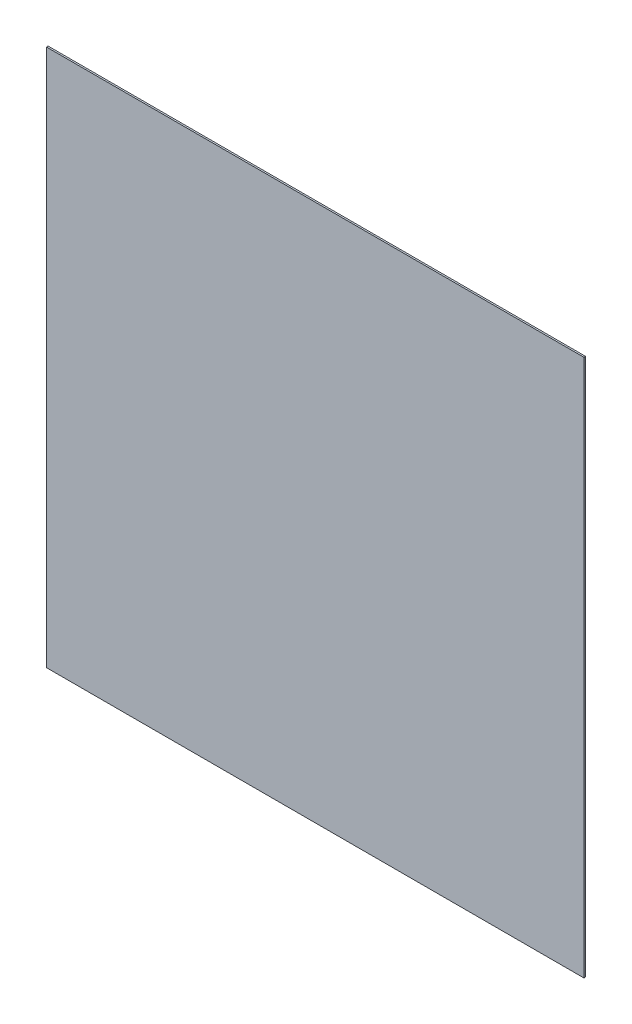
ISO-10303-21;
HEADER;
FILE_DESCRIPTION(('STEP AP214'),'2;1');
FILE_NAME('part.step','',(''),(''),'','','');
FILE_SCHEMA(('AUTOMOTIVE_DESIGN { 1 0 10303 214 1 1 1 1 }'));
ENDSEC;
DATA;
#1=APPLICATION_CONTEXT('core data for automotive mechanical design processes');
#2=APPLICATION_PROTOCOL_DEFINITION('international standard','automotive_design',2000,#1);
#3=PRODUCT_CONTEXT('',#1,'mechanical');
#4=PRODUCT('Part','Part','',(#3));
#5=PRODUCT_RELATED_PRODUCT_CATEGORY('part','',(#4));
#6=PRODUCT_DEFINITION_FORMATION('','',#4);
#7=PRODUCT_DEFINITION_CONTEXT('part definition',#1,'design');
#8=PRODUCT_DEFINITION('design','',#6,#7);
#9=PRODUCT_DEFINITION_SHAPE('','',#8);
#10=(LENGTH_UNIT() NAMED_UNIT(*) SI_UNIT(.MILLI.,.METRE.));
#11=(NAMED_UNIT(*) PLANE_ANGLE_UNIT() SI_UNIT($,.RADIAN.));
#12=(NAMED_UNIT(*) SI_UNIT($,.STERADIAN.) SOLID_ANGLE_UNIT());
#13=UNCERTAINTY_MEASURE_WITH_UNIT(LENGTH_MEASURE(1.E-05),#10,'distance_accuracy_value','');
#14=(GEOMETRIC_REPRESENTATION_CONTEXT(3) GLOBAL_UNCERTAINTY_ASSIGNED_CONTEXT((#13)) GLOBAL_UNIT_ASSIGNED_CONTEXT((#10,
#11,#12)) REPRESENTATION_CONTEXT('',''));
#15=CARTESIAN_POINT('',(0.,0.,0.));
#16=DIRECTION('',(0.,0.,1.));
#17=DIRECTION('',(1.,0.,0.));
#18=AXIS2_PLACEMENT_3D('',#15,#16,#17);
#19=CARTESIAN_POINT('',(0.221931906506307,36.6605550842403,13.76934));
#20=DIRECTION('',(0.,-1.,0.));
#21=DIRECTION('',(0.,0.,-1.));
#22=AXIS2_PLACEMENT_3D('',#19,#20,#21);
#23=PLANE('',#22);
#24=DIRECTION('',(-1.,0.,0.));
#25=VECTOR('',#24,1.);
#26=CARTESIAN_POINT('',(5.17493190650631,36.6605550842403,13.7414));
#27=LINE('',#26,#25);
#28=CARTESIAN_POINT('',(9.30243190650632,36.6605550842403,13.7414));
#29=VERTEX_POINT('',#28);
#30=CARTESIAN_POINT('',(1.04743190650631,36.6605550842403,13.7414));
#31=VERTEX_POINT('',#30);
#32=EDGE_CURVE('E77',#29,#31,#27,.T.);
#33=ORIENTED_EDGE('',*,*,#32,.F.);
#34=DIRECTION('',(0.,0.,-1.));
#35=VECTOR('',#34,1.);
#36=CARTESIAN_POINT('',(9.30243190650632,36.6605550842403,13.7541));
#37=LINE('',#36,#35);
#38=CARTESIAN_POINT('',(9.30243190650632,36.6605550842403,13.7668));
#39=VERTEX_POINT('',#38);
#40=EDGE_CURVE('E69',#39,#29,#37,.T.);
#41=ORIENTED_EDGE('',*,*,#40,.F.);
#42=DIRECTION('',(1.,0.,0.));
#43=VECTOR('',#42,1.);
#44=CARTESIAN_POINT('',(5.17493190650631,36.6605550842403,13.7668));
#45=LINE('',#44,#43);
#46=CARTESIAN_POINT('',(1.04743190650631,36.6605550842403,13.7668));
#47=VERTEX_POINT('',#46);
#48=EDGE_CURVE('E68',#47,#39,#45,.T.);
#49=ORIENTED_EDGE('',*,*,#48,.F.);
#50=DIRECTION('',(0.,0.,-1.));
#51=VECTOR('',#50,1.);
#52=CARTESIAN_POINT('',(1.04743190650631,36.6605550842403,13.7541));
#53=LINE('',#52,#51);
#54=EDGE_CURVE('E34',#47,#31,#53,.T.);
#55=ORIENTED_EDGE('',*,*,#54,.T.);
#56=EDGE_LOOP('',(#33,#41,#49,#55));
#57=FACE_BOUND('',#56,.T.);
#58=ADVANCED_FACE('F17',(#57),#23,.T.);
#59=CARTESIAN_POINT('',(0.221931906506307,44.9155550842403,13.73886));
#60=DIRECTION('',(0.,1.,0.));
#61=DIRECTION('',(0.,0.,1.));
#62=AXIS2_PLACEMENT_3D('',#59,#60,#61);
#63=PLANE('',#62);
#64=DIRECTION('',(1.,0.,0.));
#65=VECTOR('',#64,1.);
#66=CARTESIAN_POINT('',(5.17493190650631,44.9155550842403,13.7414));
#67=LINE('',#66,#65);
#68=CARTESIAN_POINT('',(1.04743190650631,44.9155550842403,13.7414));
#69=VERTEX_POINT('',#68);
#70=CARTESIAN_POINT('',(9.30243190650632,44.9155550842403,13.7414));
#71=VERTEX_POINT('',#70);
#72=EDGE_CURVE('E85',#69,#71,#67,.T.);
#73=ORIENTED_EDGE('',*,*,#72,.F.);
#74=DIRECTION('',(0.,0.,1.));
#75=VECTOR('',#74,1.);
#76=CARTESIAN_POINT('',(1.04743190650631,44.9155550842403,13.7541));
#77=LINE('',#76,#75);
#78=CARTESIAN_POINT('',(1.04743190650631,44.9155550842403,13.7668));
#79=VERTEX_POINT('',#78);
#80=EDGE_CURVE('E74',#69,#79,#77,.T.);
#81=ORIENTED_EDGE('',*,*,#80,.T.);
#82=DIRECTION('',(-1.,0.,0.));
#83=VECTOR('',#82,1.);
#84=CARTESIAN_POINT('',(5.17493190650631,44.9155550842403,13.7668));
#85=LINE('',#84,#83);
#86=CARTESIAN_POINT('',(9.30243190650632,44.9155550842403,13.7668));
#87=VERTEX_POINT('',#86);
#88=EDGE_CURVE('E72',#87,#79,#85,.T.);
#89=ORIENTED_EDGE('',*,*,#88,.F.);
#90=DIRECTION('',(0.,0.,1.));
#91=VECTOR('',#90,1.);
#92=CARTESIAN_POINT('',(9.30243190650632,44.9155550842403,13.7541));
#93=LINE('',#92,#91);
#94=EDGE_CURVE('E51',#71,#87,#93,.T.);
#95=ORIENTED_EDGE('',*,*,#94,.F.);
#96=EDGE_LOOP('',(#73,#81,#89,#95));
#97=FACE_BOUND('',#96,.T.);
#98=ADVANCED_FACE('F73',(#97),#63,.T.);
#99=CARTESIAN_POINT('',(9.30243190650632,35.8350550842403,13.76934));
#100=DIRECTION('',(1.,0.,0.));
#101=DIRECTION('',(0.,0.,-1.));
#102=AXIS2_PLACEMENT_3D('',#99,#100,#101);
#103=PLANE('',#102);
#104=DIRECTION('',(0.,-1.,0.));
#105=VECTOR('',#104,1.);
#106=CARTESIAN_POINT('',(9.30243190650632,40.7880550842403,13.7414));
#107=LINE('',#106,#105);
#108=EDGE_CURVE('E66',#71,#29,#107,.T.);
#109=ORIENTED_EDGE('',*,*,#108,.F.);
#110=ORIENTED_EDGE('',*,*,#94,.T.);
#111=DIRECTION('',(0.,1.,0.));
#112=VECTOR('',#111,1.);
#113=CARTESIAN_POINT('',(9.30243190650632,40.7880550842403,13.7668));
#114=LINE('',#113,#112);
#115=EDGE_CURVE('E63',#39,#87,#114,.T.);
#116=ORIENTED_EDGE('',*,*,#115,.F.);
#117=ORIENTED_EDGE('',*,*,#40,.T.);
#118=EDGE_LOOP('',(#109,#110,#116,#117));
#119=FACE_BOUND('',#118,.T.);
#120=ADVANCED_FACE('F60',(#119),#103,.T.);
#121=CARTESIAN_POINT('',(10.1279319065063,45.7410550842403,13.7668));
#122=DIRECTION('',(0.,0.,1.));
#123=DIRECTION('',(-1.,0.,0.));
#124=AXIS2_PLACEMENT_3D('',#121,#122,#123);
#125=PLANE('',#124);
#126=ORIENTED_EDGE('',*,*,#115,.T.);
#127=ORIENTED_EDGE('',*,*,#88,.T.);
#128=DIRECTION('',(0.,1.,0.));
#129=VECTOR('',#128,1.);
#130=CARTESIAN_POINT('',(1.04743190650631,40.7880550842403,13.7668));
#131=LINE('',#130,#129);
#132=EDGE_CURVE('E21',#47,#79,#131,.T.);
#133=ORIENTED_EDGE('',*,*,#132,.F.);
#134=ORIENTED_EDGE('',*,*,#48,.T.);
#135=EDGE_LOOP('',(#126,#127,#133,#134));
#136=FACE_BOUND('',#135,.T.);
#137=ADVANCED_FACE('F79',(#136),#125,.T.);
#138=CARTESIAN_POINT('',(10.1279319065063,35.8350550842403,13.7414));
#139=DIRECTION('',(0.,0.,-1.));
#140=DIRECTION('',(-1.,0.,0.));
#141=AXIS2_PLACEMENT_3D('',#138,#139,#140);
#142=PLANE('',#141);
#143=ORIENTED_EDGE('',*,*,#72,.T.);
#144=ORIENTED_EDGE('',*,*,#108,.T.);
#145=ORIENTED_EDGE('',*,*,#32,.T.);
#146=DIRECTION('',(0.,-1.,0.));
#147=VECTOR('',#146,1.);
#148=CARTESIAN_POINT('',(1.04743190650631,40.7880550842403,13.7414));
#149=LINE('',#148,#147);
#150=EDGE_CURVE('E11',#69,#31,#149,.T.);
#151=ORIENTED_EDGE('',*,*,#150,.F.);
#152=EDGE_LOOP('',(#143,#144,#145,#151));
#153=FACE_BOUND('',#152,.T.);
#154=ADVANCED_FACE('F89',(#153),#142,.T.);
#155=CARTESIAN_POINT('',(1.04743190650631,35.8350550842403,13.73886));
#156=DIRECTION('',(-1.,0.,0.));
#157=DIRECTION('',(0.,0.,1.));
#158=AXIS2_PLACEMENT_3D('',#155,#156,#157);
#159=PLANE('',#158);
#160=ORIENTED_EDGE('',*,*,#150,.T.);
#161=ORIENTED_EDGE('',*,*,#54,.F.);
#162=ORIENTED_EDGE('',*,*,#132,.T.);
#163=ORIENTED_EDGE('',*,*,#80,.F.);
#164=EDGE_LOOP('',(#160,#161,#162,#163));
#165=FACE_BOUND('',#164,.T.);
#166=ADVANCED_FACE('F19',(#165),#159,.T.);
#167=CLOSED_SHELL('',(#58,#98,#120,#137,#154,#166));
#168=MANIFOLD_SOLID_BREP('B1',#167);
#169=ADVANCED_BREP_SHAPE_REPRESENTATION('',(#18,#168),#14);
#170=SHAPE_DEFINITION_REPRESENTATION(#9,#169);
ENDSEC;
END-ISO-10303-21;
